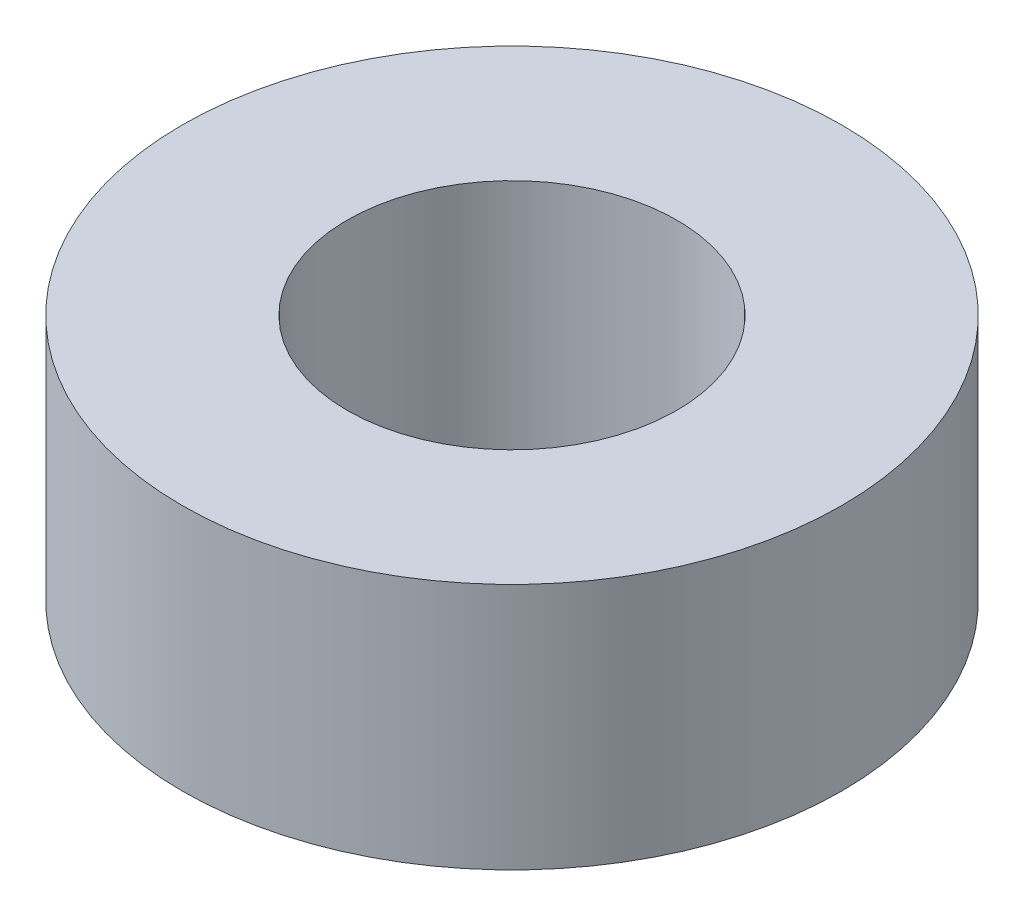
ISO-10303-21;
HEADER;
FILE_DESCRIPTION(('STEP AP214'),'2;1');
FILE_NAME('part.step','',(''),(''),'','','');
FILE_SCHEMA(('AUTOMOTIVE_DESIGN { 1 0 10303 214 1 1 1 1 }'));
ENDSEC;
DATA;
#1=APPLICATION_CONTEXT('core data for automotive mechanical design processes');
#2=APPLICATION_PROTOCOL_DEFINITION('international standard','automotive_design',2000,#1);
#3=PRODUCT_CONTEXT('',#1,'mechanical');
#4=PRODUCT('Part','Part','',(#3));
#5=PRODUCT_RELATED_PRODUCT_CATEGORY('part','',(#4));
#6=PRODUCT_DEFINITION_FORMATION('','',#4);
#7=PRODUCT_DEFINITION_CONTEXT('part definition',#1,'design');
#8=PRODUCT_DEFINITION('design','',#6,#7);
#9=PRODUCT_DEFINITION_SHAPE('','',#8);
#10=(LENGTH_UNIT() NAMED_UNIT(*) SI_UNIT(.MILLI.,.METRE.));
#11=(NAMED_UNIT(*) PLANE_ANGLE_UNIT() SI_UNIT($,.RADIAN.));
#12=(NAMED_UNIT(*) SI_UNIT($,.STERADIAN.) SOLID_ANGLE_UNIT());
#13=UNCERTAINTY_MEASURE_WITH_UNIT(LENGTH_MEASURE(1.E-05),#10,'distance_accuracy_value','');
#14=(GEOMETRIC_REPRESENTATION_CONTEXT(3) GLOBAL_UNCERTAINTY_ASSIGNED_CONTEXT((#13)) GLOBAL_UNIT_ASSIGNED_CONTEXT((#10,
#11,#12)) REPRESENTATION_CONTEXT('',''));
#15=CARTESIAN_POINT('',(0.,0.,0.));
#16=DIRECTION('',(0.,0.,1.));
#17=DIRECTION('',(1.,0.,0.));
#18=AXIS2_PLACEMENT_3D('',#15,#16,#17);
#19=CARTESIAN_POINT('',(0.,4.7625,0.));
#20=DIRECTION('',(0.,1.,0.));
#21=DIRECTION('',(0.,0.,1.));
#22=AXIS2_PLACEMENT_3D('',#19,#20,#21);
#23=PLANE('',#22);
#24=CARTESIAN_POINT('',(0.,4.7625,0.));
#25=DIRECTION('',(0.,1.,0.));
#26=DIRECTION('',(0.,0.,1.));
#27=AXIS2_PLACEMENT_3D('',#24,#25,#26);
#28=CIRCLE('',#27,6.35);
#29=CARTESIAN_POINT('',(0.,4.7625,6.35));
#30=VERTEX_POINT('',#29);
#31=EDGE_CURVE('E10',#30,#30,#28,.T.);
#32=ORIENTED_EDGE('',*,*,#31,.T.);
#33=EDGE_LOOP('',(#32));
#34=FACE_BOUND('',#33,.T.);
#35=CARTESIAN_POINT('',(0.,4.7625,0.));
#36=DIRECTION('',(0.,1.,0.));
#37=DIRECTION('',(0.,0.,1.));
#38=AXIS2_PLACEMENT_3D('',#35,#36,#37);
#39=CIRCLE('',#38,3.175);
#40=CARTESIAN_POINT('',(0.,4.7625,3.175));
#41=VERTEX_POINT('',#40);
#42=EDGE_CURVE('E52',#41,#41,#39,.T.);
#43=ORIENTED_EDGE('',*,*,#42,.F.);
#44=EDGE_LOOP('',(#43));
#45=FACE_BOUND('',#44,.T.);
#46=ADVANCED_FACE('F41',(#34,#45),#23,.T.);
#47=CARTESIAN_POINT('',(0.,0.,0.));
#48=DIRECTION('',(0.,1.,0.));
#49=DIRECTION('',(0.,0.,1.));
#50=AXIS2_PLACEMENT_3D('',#47,#48,#49);
#51=PLANE('',#50);
#52=CARTESIAN_POINT('',(0.,0.,0.));
#53=DIRECTION('',(0.,1.,0.));
#54=DIRECTION('',(0.,0.,1.));
#55=AXIS2_PLACEMENT_3D('',#52,#53,#54);
#56=CIRCLE('',#55,6.35);
#57=CARTESIAN_POINT('',(0.,0.,6.35));
#58=VERTEX_POINT('',#57);
#59=EDGE_CURVE('E45',#58,#58,#56,.T.);
#60=ORIENTED_EDGE('',*,*,#59,.F.);
#61=EDGE_LOOP('',(#60));
#62=FACE_BOUND('',#61,.T.);
#63=CARTESIAN_POINT('',(0.,0.,0.));
#64=DIRECTION('',(0.,1.,0.));
#65=DIRECTION('',(0.,0.,1.));
#66=AXIS2_PLACEMENT_3D('',#63,#64,#65);
#67=CIRCLE('',#66,3.175);
#68=CARTESIAN_POINT('',(0.,0.,3.175));
#69=VERTEX_POINT('',#68);
#70=EDGE_CURVE('E54',#69,#69,#67,.T.);
#71=ORIENTED_EDGE('',*,*,#70,.T.);
#72=EDGE_LOOP('',(#71));
#73=FACE_BOUND('',#72,.T.);
#74=ADVANCED_FACE('F64',(#62,#73),#51,.F.);
#75=CARTESIAN_POINT('',(0.,4.7625,0.));
#76=DIRECTION('',(0.,-1.,0.));
#77=DIRECTION('',(0.,0.,-1.));
#78=AXIS2_PLACEMENT_3D('',#75,#76,#77);
#79=CYLINDRICAL_SURFACE('',#78,6.35);
#80=ORIENTED_EDGE('',*,*,#31,.F.);
#81=EDGE_LOOP('',(#80));
#82=FACE_BOUND('',#81,.T.);
#83=ORIENTED_EDGE('',*,*,#59,.T.);
#84=EDGE_LOOP('',(#83));
#85=FACE_BOUND('',#84,.T.);
#86=ADVANCED_FACE('F43',(#82,#85),#79,.T.);
#87=CARTESIAN_POINT('',(0.,4.7625,0.));
#88=DIRECTION('',(0.,-1.,0.));
#89=DIRECTION('',(0.,0.,-1.));
#90=AXIS2_PLACEMENT_3D('',#87,#88,#89);
#91=CYLINDRICAL_SURFACE('',#90,3.175);
#92=ORIENTED_EDGE('',*,*,#42,.T.);
#93=EDGE_LOOP('',(#92));
#94=FACE_BOUND('',#93,.T.);
#95=ORIENTED_EDGE('',*,*,#70,.F.);
#96=EDGE_LOOP('',(#95));
#97=FACE_BOUND('',#96,.T.);
#98=ADVANCED_FACE('F60',(#94,#97),#91,.F.);
#99=CLOSED_SHELL('',(#46,#74,#86,#98));
#100=MANIFOLD_SOLID_BREP('B2',#99);
#101=ADVANCED_BREP_SHAPE_REPRESENTATION('',(#18,#100),#14);
#102=SHAPE_DEFINITION_REPRESENTATION(#9,#101);
ENDSEC;
END-ISO-10303-21;
